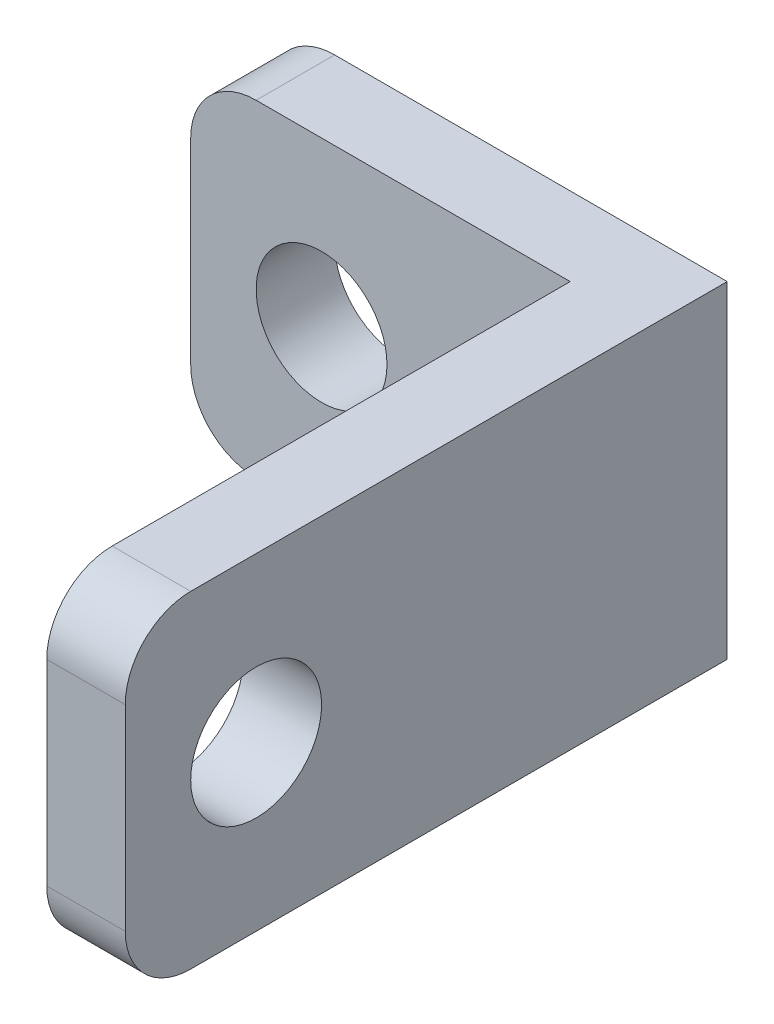
ISO-10303-21;
HEADER;
FILE_DESCRIPTION(('STEP AP214'),'2;1');
FILE_NAME('part.step','',(''),(''),'','','');
FILE_SCHEMA(('AUTOMOTIVE_DESIGN { 1 0 10303 214 1 1 1 1 }'));
ENDSEC;
DATA;
#1=APPLICATION_CONTEXT('core data for automotive mechanical design processes');
#2=APPLICATION_PROTOCOL_DEFINITION('international standard','automotive_design',2000,#1);
#3=PRODUCT_CONTEXT('',#1,'mechanical');
#4=PRODUCT('Part','Part','',(#3));
#5=PRODUCT_RELATED_PRODUCT_CATEGORY('part','',(#4));
#6=PRODUCT_DEFINITION_FORMATION('','',#4);
#7=PRODUCT_DEFINITION_CONTEXT('part definition',#1,'design');
#8=PRODUCT_DEFINITION('design','',#6,#7);
#9=PRODUCT_DEFINITION_SHAPE('','',#8);
#10=(LENGTH_UNIT() NAMED_UNIT(*) SI_UNIT(.MILLI.,.METRE.));
#11=(NAMED_UNIT(*) PLANE_ANGLE_UNIT() SI_UNIT($,.RADIAN.));
#12=(NAMED_UNIT(*) SI_UNIT($,.STERADIAN.) SOLID_ANGLE_UNIT());
#13=UNCERTAINTY_MEASURE_WITH_UNIT(LENGTH_MEASURE(1.E-05),#10,'distance_accuracy_value','');
#14=(GEOMETRIC_REPRESENTATION_CONTEXT(3) GLOBAL_UNCERTAINTY_ASSIGNED_CONTEXT((#13)) GLOBAL_UNIT_ASSIGNED_CONTEXT((#10,
#11,#12)) REPRESENTATION_CONTEXT('',''));
#15=CARTESIAN_POINT('',(0.,0.,0.));
#16=DIRECTION('',(0.,0.,1.));
#17=DIRECTION('',(1.,0.,0.));
#18=AXIS2_PLACEMENT_3D('',#15,#16,#17);
#19=CARTESIAN_POINT('',(1.,4.,1.2));
#20=DIRECTION('',(0.,0.,-1.));
#21=DIRECTION('',(-1.,0.,0.));
#22=AXIS2_PLACEMENT_3D('',#19,#20,#21);
#23=PLANE('',#22);
#24=DIRECTION('',(1.,0.,0.));
#25=VECTOR('',#24,1.);
#26=CARTESIAN_POINT('',(1.00000000000001,0.,1.2));
#27=LINE('',#26,#25);
#28=CARTESIAN_POINT('',(1.00000000000001,0.,1.2));
#29=VERTEX_POINT('',#28);
#30=CARTESIAN_POINT('',(5.8,0.,1.2));
#31=VERTEX_POINT('',#30);
#32=EDGE_CURVE('E126',#29,#31,#27,.T.);
#33=ORIENTED_EDGE('',*,*,#32,.T.);
#34=DIRECTION('',(0.,1.,0.));
#35=VECTOR('',#34,1.);
#36=CARTESIAN_POINT('',(5.8,0.,1.2));
#37=LINE('',#36,#35);
#38=CARTESIAN_POINT('',(5.8,5.,1.2));
#39=VERTEX_POINT('',#38);
#40=EDGE_CURVE('E135',#31,#39,#37,.T.);
#41=ORIENTED_EDGE('',*,*,#40,.T.);
#42=DIRECTION('',(-1.,0.,0.));
#43=VECTOR('',#42,1.);
#44=CARTESIAN_POINT('',(1.,5.,1.2));
#45=LINE('',#44,#43);
#46=CARTESIAN_POINT('',(1.,5.,1.2));
#47=VERTEX_POINT('',#46);
#48=EDGE_CURVE('E179',#39,#47,#45,.T.);
#49=ORIENTED_EDGE('',*,*,#48,.T.);
#50=CARTESIAN_POINT('',(1.,4.,1.2));
#51=DIRECTION('',(0.,0.,1.));
#52=DIRECTION('',(-1.,0.,0.));
#53=AXIS2_PLACEMENT_3D('',#50,#51,#52);
#54=CIRCLE('',#53,1.);
#55=CARTESIAN_POINT('',(0.,4.,1.2));
#56=VERTEX_POINT('',#55);
#57=EDGE_CURVE('E241',#47,#56,#54,.T.);
#58=ORIENTED_EDGE('',*,*,#57,.T.);
#59=DIRECTION('',(0.,-1.,0.));
#60=VECTOR('',#59,1.);
#61=CARTESIAN_POINT('',(0.,1.00000000000001,1.2));
#62=LINE('',#61,#60);
#63=CARTESIAN_POINT('',(0.,1.00000000000001,1.2));
#64=VERTEX_POINT('',#63);
#65=EDGE_CURVE('E155',#56,#64,#62,.T.);
#66=ORIENTED_EDGE('',*,*,#65,.T.);
#67=CARTESIAN_POINT('',(1.,1.,1.2));
#68=DIRECTION('',(0.,0.,1.));
#69=DIRECTION('',(-1.,0.,0.));
#70=AXIS2_PLACEMENT_3D('',#67,#68,#69);
#71=CIRCLE('',#70,1.);
#72=EDGE_CURVE('E146',#64,#29,#71,.T.);
#73=ORIENTED_EDGE('',*,*,#72,.T.);
#74=EDGE_LOOP('',(#33,#41,#49,#58,#66,#73));
#75=FACE_BOUND('',#74,.T.);
#76=CARTESIAN_POINT('',(2.,2.5,1.2));
#77=DIRECTION('',(0.,0.,1.));
#78=DIRECTION('',(1.,0.,0.));
#79=AXIS2_PLACEMENT_3D('',#76,#77,#78);
#80=CIRCLE('',#79,1.);
#81=CARTESIAN_POINT('',(3.,2.5,1.2));
#82=VERTEX_POINT('',#81);
#83=EDGE_CURVE('E164',#82,#82,#80,.T.);
#84=ORIENTED_EDGE('',*,*,#83,.F.);
#85=EDGE_LOOP('',(#84));
#86=FACE_BOUND('',#85,.T.);
#87=ADVANCED_FACE('F39',(#75,#86),#23,.F.);
#88=CARTESIAN_POINT('',(1.,4.,0.));
#89=DIRECTION('',(0.,0.,-1.));
#90=DIRECTION('',(-1.,0.,0.));
#91=AXIS2_PLACEMENT_3D('',#88,#89,#90);
#92=PLANE('',#91);
#93=DIRECTION('',(0.,1.,0.));
#94=VECTOR('',#93,1.);
#95=CARTESIAN_POINT('',(7.,0.,0.));
#96=LINE('',#95,#94);
#97=CARTESIAN_POINT('',(7.,0.,0.));
#98=VERTEX_POINT('',#97);
#99=CARTESIAN_POINT('',(7.,5.,0.));
#100=VERTEX_POINT('',#99);
#101=EDGE_CURVE('E159',#98,#100,#96,.T.);
#102=ORIENTED_EDGE('',*,*,#101,.F.);
#103=DIRECTION('',(1.,0.,0.));
#104=VECTOR('',#103,1.);
#105=CARTESIAN_POINT('',(1.00000000000001,0.,0.));
#106=LINE('',#105,#104);
#107=CARTESIAN_POINT('',(1.00000000000001,0.,0.));
#108=VERTEX_POINT('',#107);
#109=EDGE_CURVE('E176',#108,#98,#106,.T.);
#110=ORIENTED_EDGE('',*,*,#109,.F.);
#111=CARTESIAN_POINT('',(1.,1.,0.));
#112=DIRECTION('',(0.,0.,1.));
#113=DIRECTION('',(-1.,0.,0.));
#114=AXIS2_PLACEMENT_3D('',#111,#112,#113);
#115=CIRCLE('',#114,1.);
#116=CARTESIAN_POINT('',(0.,1.00000000000001,0.));
#117=VERTEX_POINT('',#116);
#118=EDGE_CURVE('E173',#117,#108,#115,.T.);
#119=ORIENTED_EDGE('',*,*,#118,.F.);
#120=DIRECTION('',(0.,-1.,0.));
#121=VECTOR('',#120,1.);
#122=CARTESIAN_POINT('',(0.,1.00000000000001,0.));
#123=LINE('',#122,#121);
#124=CARTESIAN_POINT('',(0.,4.,0.));
#125=VERTEX_POINT('',#124);
#126=EDGE_CURVE('E170',#125,#117,#123,.T.);
#127=ORIENTED_EDGE('',*,*,#126,.F.);
#128=CARTESIAN_POINT('',(1.,4.,0.));
#129=DIRECTION('',(0.,0.,1.));
#130=DIRECTION('',(-1.,0.,0.));
#131=AXIS2_PLACEMENT_3D('',#128,#129,#130);
#132=CIRCLE('',#131,1.);
#133=CARTESIAN_POINT('',(1.,5.,0.));
#134=VERTEX_POINT('',#133);
#135=EDGE_CURVE('E167',#134,#125,#132,.T.);
#136=ORIENTED_EDGE('',*,*,#135,.F.);
#137=DIRECTION('',(-1.,0.,0.));
#138=VECTOR('',#137,1.);
#139=CARTESIAN_POINT('',(1.,5.,0.));
#140=LINE('',#139,#138);
#141=EDGE_CURVE('E163',#100,#134,#140,.T.);
#142=ORIENTED_EDGE('',*,*,#141,.F.);
#143=EDGE_LOOP('',(#102,#110,#119,#127,#136,#142));
#144=FACE_BOUND('',#143,.T.);
#145=CARTESIAN_POINT('',(2.,2.5,0.));
#146=DIRECTION('',(0.,0.,1.));
#147=DIRECTION('',(1.,0.,0.));
#148=AXIS2_PLACEMENT_3D('',#145,#146,#147);
#149=CIRCLE('',#148,1.);
#150=CARTESIAN_POINT('',(3.,2.5,0.));
#151=VERTEX_POINT('',#150);
#152=EDGE_CURVE('E131',#151,#151,#149,.T.);
#153=ORIENTED_EDGE('',*,*,#152,.T.);
#154=EDGE_LOOP('',(#153));
#155=FACE_BOUND('',#154,.T.);
#156=ADVANCED_FACE('F255',(#144,#155),#92,.T.);
#157=CARTESIAN_POINT('',(7.,0.,1.2));
#158=DIRECTION('',(-1.,0.,0.));
#159=DIRECTION('',(0.,0.,1.));
#160=AXIS2_PLACEMENT_3D('',#157,#158,#159);
#161=PLANE('',#160);
#162=CARTESIAN_POINT('',(7.,2.5,7.2));
#163=DIRECTION('',(-1.,0.,0.));
#164=DIRECTION('',(0.,0.,1.));
#165=AXIS2_PLACEMENT_3D('',#162,#163,#164);
#166=CIRCLE('',#165,0.999999999999998);
#167=CARTESIAN_POINT('',(7.,2.5,8.2));
#168=VERTEX_POINT('',#167);
#169=EDGE_CURVE('E142',#168,#168,#166,.T.);
#170=ORIENTED_EDGE('',*,*,#169,.T.);
#171=EDGE_LOOP('',(#170));
#172=FACE_BOUND('',#171,.T.);
#173=DIRECTION('',(0.,-1.,0.));
#174=VECTOR('',#173,1.);
#175=CARTESIAN_POINT('',(7.,0.,9.2));
#176=LINE('',#175,#174);
#177=CARTESIAN_POINT('',(7.,4.,9.2));
#178=VERTEX_POINT('',#177);
#179=CARTESIAN_POINT('',(7.,1.,9.2));
#180=VERTEX_POINT('',#179);
#181=EDGE_CURVE('E216',#178,#180,#176,.T.);
#182=ORIENTED_EDGE('',*,*,#181,.T.);
#183=CARTESIAN_POINT('',(7.,1.,8.2));
#184=DIRECTION('',(-1.,0.,0.));
#185=DIRECTION('',(0.,0.,1.));
#186=AXIS2_PLACEMENT_3D('',#183,#184,#185);
#187=CIRCLE('',#186,1.);
#188=CARTESIAN_POINT('',(7.,0.,8.2));
#189=VERTEX_POINT('',#188);
#190=EDGE_CURVE('E48',#180,#189,#187,.F.);
#191=ORIENTED_EDGE('',*,*,#190,.T.);
#192=DIRECTION('',(0.,0.,-1.));
#193=VECTOR('',#192,1.);
#194=CARTESIAN_POINT('',(7.,0.,1.2));
#195=LINE('',#194,#193);
#196=EDGE_CURVE('E149',#189,#98,#195,.T.);
#197=ORIENTED_EDGE('',*,*,#196,.T.);
#198=ORIENTED_EDGE('',*,*,#101,.T.);
#199=DIRECTION('',(0.,0.,-1.));
#200=VECTOR('',#199,1.);
#201=CARTESIAN_POINT('',(7.,5.,1.2));
#202=LINE('',#201,#200);
#203=CARTESIAN_POINT('',(7.,5.,8.2));
#204=VERTEX_POINT('',#203);
#205=EDGE_CURVE('E195',#204,#100,#202,.T.);
#206=ORIENTED_EDGE('',*,*,#205,.F.);
#207=CARTESIAN_POINT('',(7.,4.,8.2));
#208=DIRECTION('',(-1.,0.,0.));
#209=DIRECTION('',(0.,0.,1.));
#210=AXIS2_PLACEMENT_3D('',#207,#208,#209);
#211=CIRCLE('',#210,1.);
#212=EDGE_CURVE('E55',#204,#178,#211,.F.);
#213=ORIENTED_EDGE('',*,*,#212,.T.);
#214=EDGE_LOOP('',(#182,#191,#197,#198,#206,#213));
#215=FACE_BOUND('',#214,.T.);
#216=ADVANCED_FACE('F215',(#172,#215),#161,.F.);
#217=CARTESIAN_POINT('',(1.,5.,1.2));
#218=DIRECTION('',(0.,-1.,0.));
#219=DIRECTION('',(1.,0.,0.));
#220=AXIS2_PLACEMENT_3D('',#217,#218,#219);
#221=PLANE('',#220);
#222=DIRECTION('',(0.,0.,-1.));
#223=VECTOR('',#222,1.);
#224=CARTESIAN_POINT('',(5.8,5.,9.2));
#225=LINE('',#224,#223);
#226=CARTESIAN_POINT('',(5.8,5.,8.2));
#227=VERTEX_POINT('',#226);
#228=EDGE_CURVE('E132',#227,#39,#225,.T.);
#229=ORIENTED_EDGE('',*,*,#228,.F.);
#230=DIRECTION('',(1.,0.,0.));
#231=VECTOR('',#230,1.);
#232=CARTESIAN_POINT('',(1.,5.,8.2));
#233=LINE('',#232,#231);
#234=EDGE_CURVE('E11',#227,#204,#233,.T.);
#235=ORIENTED_EDGE('',*,*,#234,.T.);
#236=ORIENTED_EDGE('',*,*,#205,.T.);
#237=ORIENTED_EDGE('',*,*,#141,.T.);
#238=DIRECTION('',(0.,0.,-1.));
#239=VECTOR('',#238,1.);
#240=CARTESIAN_POINT('',(1.,5.,1.2));
#241=LINE('',#240,#239);
#242=EDGE_CURVE('E191',#47,#134,#241,.T.);
#243=ORIENTED_EDGE('',*,*,#242,.F.);
#244=ORIENTED_EDGE('',*,*,#48,.F.);
#245=EDGE_LOOP('',(#229,#235,#236,#237,#243,#244));
#246=FACE_BOUND('',#245,.T.);
#247=ADVANCED_FACE('F261',(#246),#221,.F.);
#248=CARTESIAN_POINT('',(1.,4.,1.2));
#249=DIRECTION('',(0.,0.,-1.));
#250=DIRECTION('',(-1.,0.,0.));
#251=AXIS2_PLACEMENT_3D('',#248,#249,#250);
#252=CYLINDRICAL_SURFACE('',#251,1.);
#253=ORIENTED_EDGE('',*,*,#135,.T.);
#254=DIRECTION('',(0.,0.,-1.));
#255=VECTOR('',#254,1.);
#256=CARTESIAN_POINT('',(0.,4.,1.2));
#257=LINE('',#256,#255);
#258=EDGE_CURVE('E187',#56,#125,#257,.T.);
#259=ORIENTED_EDGE('',*,*,#258,.F.);
#260=ORIENTED_EDGE('',*,*,#57,.F.);
#261=ORIENTED_EDGE('',*,*,#242,.T.);
#262=EDGE_LOOP('',(#253,#259,#260,#261));
#263=FACE_BOUND('',#262,.T.);
#264=ADVANCED_FACE('F287',(#263),#252,.T.);
#265=CARTESIAN_POINT('',(0.,1.00000000000001,1.2));
#266=DIRECTION('',(1.,0.,0.));
#267=DIRECTION('',(0.,0.,-1.));
#268=AXIS2_PLACEMENT_3D('',#265,#266,#267);
#269=PLANE('',#268);
#270=ORIENTED_EDGE('',*,*,#126,.T.);
#271=DIRECTION('',(0.,0.,-1.));
#272=VECTOR('',#271,1.);
#273=CARTESIAN_POINT('',(0.,1.00000000000001,1.2));
#274=LINE('',#273,#272);
#275=EDGE_CURVE('E183',#64,#117,#274,.T.);
#276=ORIENTED_EDGE('',*,*,#275,.F.);
#277=ORIENTED_EDGE('',*,*,#65,.F.);
#278=ORIENTED_EDGE('',*,*,#258,.T.);
#279=EDGE_LOOP('',(#270,#276,#277,#278));
#280=FACE_BOUND('',#279,.T.);
#281=ADVANCED_FACE('F249',(#280),#269,.F.);
#282=CARTESIAN_POINT('',(1.,1.,1.2));
#283=DIRECTION('',(0.,0.,-1.));
#284=DIRECTION('',(-1.,0.,0.));
#285=AXIS2_PLACEMENT_3D('',#282,#283,#284);
#286=CYLINDRICAL_SURFACE('',#285,1.);
#287=ORIENTED_EDGE('',*,*,#118,.T.);
#288=DIRECTION('',(0.,0.,-1.));
#289=VECTOR('',#288,1.);
#290=CARTESIAN_POINT('',(1.00000000000001,0.,1.2));
#291=LINE('',#290,#289);
#292=EDGE_CURVE('E153',#29,#108,#291,.T.);
#293=ORIENTED_EDGE('',*,*,#292,.F.);
#294=ORIENTED_EDGE('',*,*,#72,.F.);
#295=ORIENTED_EDGE('',*,*,#275,.T.);
#296=EDGE_LOOP('',(#287,#293,#294,#295));
#297=FACE_BOUND('',#296,.T.);
#298=ADVANCED_FACE('F253',(#297),#286,.T.);
#299=CARTESIAN_POINT('',(1.00000000000001,0.,1.2));
#300=DIRECTION('',(0.,1.,0.));
#301=DIRECTION('',(0.,0.,1.));
#302=AXIS2_PLACEMENT_3D('',#299,#300,#301);
#303=PLANE('',#302);
#304=ORIENTED_EDGE('',*,*,#196,.F.);
#305=DIRECTION('',(-1.,0.,0.));
#306=VECTOR('',#305,1.);
#307=CARTESIAN_POINT('',(1.00000000000001,0.,8.2));
#308=LINE('',#307,#306);
#309=CARTESIAN_POINT('',(5.8,0.,8.2));
#310=VERTEX_POINT('',#309);
#311=EDGE_CURVE('E128',#189,#310,#308,.T.);
#312=ORIENTED_EDGE('',*,*,#311,.T.);
#313=DIRECTION('',(0.,0.,-1.));
#314=VECTOR('',#313,1.);
#315=CARTESIAN_POINT('',(5.8,0.,9.2));
#316=LINE('',#315,#314);
#317=EDGE_CURVE('E120',#310,#31,#316,.T.);
#318=ORIENTED_EDGE('',*,*,#317,.T.);
#319=ORIENTED_EDGE('',*,*,#32,.F.);
#320=ORIENTED_EDGE('',*,*,#292,.T.);
#321=ORIENTED_EDGE('',*,*,#109,.T.);
#322=EDGE_LOOP('',(#304,#312,#318,#319,#320,#321));
#323=FACE_BOUND('',#322,.T.);
#324=ADVANCED_FACE('F123',(#323),#303,.F.);
#325=CARTESIAN_POINT('',(2.,2.5,1.2));
#326=DIRECTION('',(0.,0.,-1.));
#327=DIRECTION('',(-1.,0.,0.));
#328=AXIS2_PLACEMENT_3D('',#325,#326,#327);
#329=CYLINDRICAL_SURFACE('',#328,1.);
#330=ORIENTED_EDGE('',*,*,#83,.T.);
#331=EDGE_LOOP('',(#330));
#332=FACE_BOUND('',#331,.T.);
#333=ORIENTED_EDGE('',*,*,#152,.F.);
#334=EDGE_LOOP('',(#333));
#335=FACE_BOUND('',#334,.T.);
#336=ADVANCED_FACE('F278',(#332,#335),#329,.F.);
#337=CARTESIAN_POINT('',(5.8,0.,9.2));
#338=DIRECTION('',(-1.,0.,0.));
#339=DIRECTION('',(0.,0.,1.));
#340=AXIS2_PLACEMENT_3D('',#337,#338,#339);
#341=PLANE('',#340);
#342=CARTESIAN_POINT('',(5.8,2.5,7.2));
#343=DIRECTION('',(-1.,0.,0.));
#344=DIRECTION('',(0.,0.,1.));
#345=AXIS2_PLACEMENT_3D('',#342,#343,#344);
#346=CIRCLE('',#345,0.999999999999998);
#347=CARTESIAN_POINT('',(5.8,2.5,8.2));
#348=VERTEX_POINT('',#347);
#349=EDGE_CURVE('E301',#348,#348,#346,.T.);
#350=ORIENTED_EDGE('',*,*,#349,.F.);
#351=EDGE_LOOP('',(#350));
#352=FACE_BOUND('',#351,.T.);
#353=ORIENTED_EDGE('',*,*,#317,.F.);
#354=CARTESIAN_POINT('',(5.8,1.,8.2));
#355=DIRECTION('',(-1.,0.,0.));
#356=DIRECTION('',(0.,0.,1.));
#357=AXIS2_PLACEMENT_3D('',#354,#355,#356);
#358=CIRCLE('',#357,1.);
#359=CARTESIAN_POINT('',(5.8,1.,9.2));
#360=VERTEX_POINT('',#359);
#361=EDGE_CURVE('E203',#310,#360,#358,.T.);
#362=ORIENTED_EDGE('',*,*,#361,.T.);
#363=DIRECTION('',(0.,1.,0.));
#364=VECTOR('',#363,1.);
#365=CARTESIAN_POINT('',(5.8,0.,9.2));
#366=LINE('',#365,#364);
#367=CARTESIAN_POINT('',(5.8,4.,9.2));
#368=VERTEX_POINT('',#367);
#369=EDGE_CURVE('E141',#360,#368,#366,.T.);
#370=ORIENTED_EDGE('',*,*,#369,.T.);
#371=CARTESIAN_POINT('',(5.8,4.,8.2));
#372=DIRECTION('',(-1.,0.,0.));
#373=DIRECTION('',(0.,0.,1.));
#374=AXIS2_PLACEMENT_3D('',#371,#372,#373);
#375=CIRCLE('',#374,1.);
#376=EDGE_CURVE('E200',#368,#227,#375,.T.);
#377=ORIENTED_EDGE('',*,*,#376,.T.);
#378=ORIENTED_EDGE('',*,*,#228,.T.);
#379=ORIENTED_EDGE('',*,*,#40,.F.);
#380=EDGE_LOOP('',(#353,#362,#370,#377,#378,#379));
#381=FACE_BOUND('',#380,.T.);
#382=ADVANCED_FACE('F136',(#352,#381),#341,.T.);
#383=CARTESIAN_POINT('',(0.,0.,9.2));
#384=DIRECTION('',(0.,0.,-1.));
#385=DIRECTION('',(-1.,0.,0.));
#386=AXIS2_PLACEMENT_3D('',#383,#384,#385);
#387=PLANE('',#386);
#388=ORIENTED_EDGE('',*,*,#369,.F.);
#389=DIRECTION('',(-1.,0.,0.));
#390=VECTOR('',#389,1.);
#391=CARTESIAN_POINT('',(0.,1.,9.2));
#392=LINE('',#391,#390);
#393=EDGE_CURVE('E62',#360,#180,#392,.F.);
#394=ORIENTED_EDGE('',*,*,#393,.T.);
#395=ORIENTED_EDGE('',*,*,#181,.F.);
#396=DIRECTION('',(1.,0.,0.));
#397=VECTOR('',#396,1.);
#398=CARTESIAN_POINT('',(0.,4.,9.2));
#399=LINE('',#398,#397);
#400=EDGE_CURVE('E206',#178,#368,#399,.F.);
#401=ORIENTED_EDGE('',*,*,#400,.T.);
#402=EDGE_LOOP('',(#388,#394,#395,#401));
#403=FACE_BOUND('',#402,.T.);
#404=ADVANCED_FACE('F223',(#403),#387,.F.);
#405=CARTESIAN_POINT('',(1.00000000000001,1.,8.2));
#406=DIRECTION('',(-1.,0.,0.));
#407=DIRECTION('',(0.,0.,1.));
#408=AXIS2_PLACEMENT_3D('',#405,#406,#407);
#409=CYLINDRICAL_SURFACE('',#408,1.);
#410=ORIENTED_EDGE('',*,*,#190,.F.);
#411=ORIENTED_EDGE('',*,*,#393,.F.);
#412=ORIENTED_EDGE('',*,*,#361,.F.);
#413=ORIENTED_EDGE('',*,*,#311,.F.);
#414=EDGE_LOOP('',(#410,#411,#412,#413));
#415=FACE_BOUND('',#414,.T.);
#416=ADVANCED_FACE('F220',(#415),#409,.T.);
#417=CARTESIAN_POINT('',(1.,4.,8.2));
#418=DIRECTION('',(1.,0.,0.));
#419=DIRECTION('',(0.,1.,0.));
#420=AXIS2_PLACEMENT_3D('',#417,#418,#419);
#421=CYLINDRICAL_SURFACE('',#420,1.);
#422=ORIENTED_EDGE('',*,*,#376,.F.);
#423=ORIENTED_EDGE('',*,*,#400,.F.);
#424=ORIENTED_EDGE('',*,*,#212,.F.);
#425=ORIENTED_EDGE('',*,*,#234,.F.);
#426=EDGE_LOOP('',(#422,#423,#424,#425));
#427=FACE_BOUND('',#426,.T.);
#428=ADVANCED_FACE('F41',(#427),#421,.T.);
#429=CARTESIAN_POINT('',(7.8,2.5,7.2));
#430=DIRECTION('',(-1.,0.,0.));
#431=DIRECTION('',(0.,0.,1.));
#432=AXIS2_PLACEMENT_3D('',#429,#430,#431);
#433=CYLINDRICAL_SURFACE('',#432,0.999999999999998);
#434=ORIENTED_EDGE('',*,*,#349,.T.);
#435=EDGE_LOOP('',(#434));
#436=FACE_BOUND('',#435,.T.);
#437=ORIENTED_EDGE('',*,*,#169,.F.);
#438=EDGE_LOOP('',(#437));
#439=FACE_BOUND('',#438,.T.);
#440=ADVANCED_FACE('F264',(#436,#439),#433,.F.);
#441=CLOSED_SHELL('',(#87,#156,#216,#247,#264,#281,#298,#324,#336,#382,#404,#416,#428,#440));
#442=MANIFOLD_SOLID_BREP('B2',#441);
#443=ADVANCED_BREP_SHAPE_REPRESENTATION('',(#18,#442),#14);
#444=SHAPE_DEFINITION_REPRESENTATION(#9,#443);
ENDSEC;
END-ISO-10303-21;
